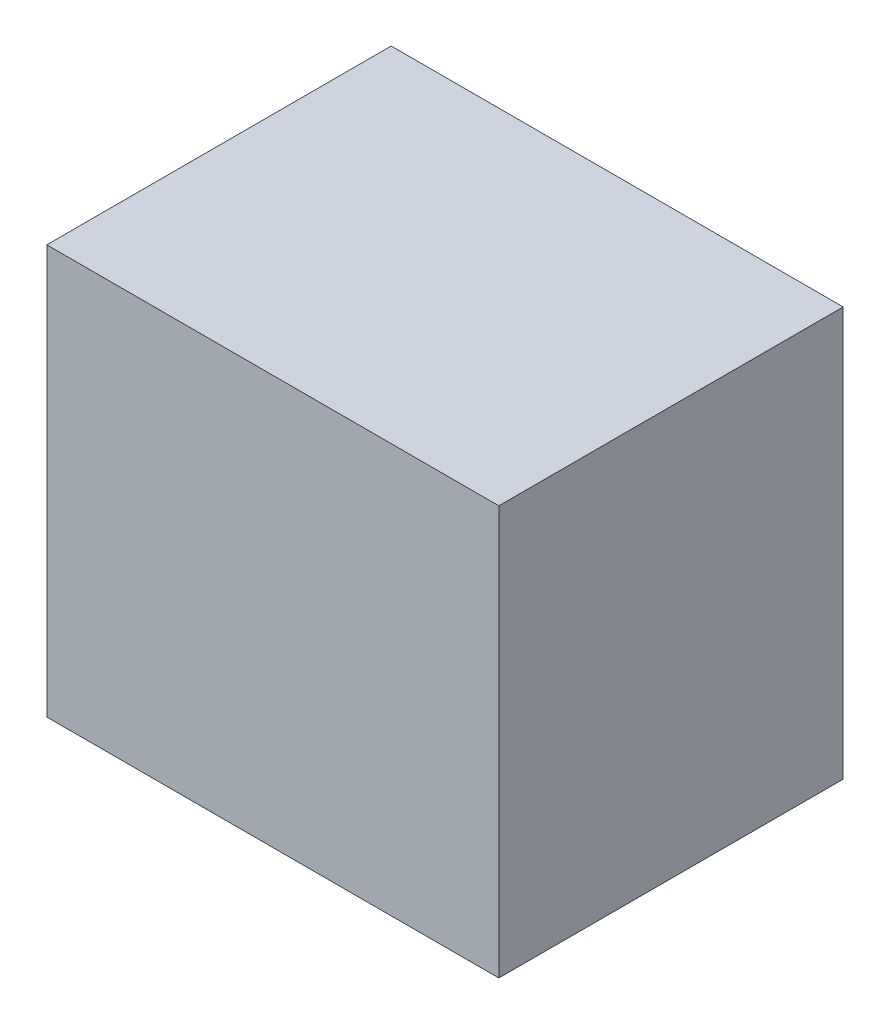
ISO-10303-21;
HEADER;
FILE_DESCRIPTION(('STEP AP214'),'2;1');
FILE_NAME('part.step','',(''),(''),'','','');
FILE_SCHEMA(('AUTOMOTIVE_DESIGN { 1 0 10303 214 1 1 1 1 }'));
ENDSEC;
DATA;
#1=APPLICATION_CONTEXT('core data for automotive mechanical design processes');
#2=APPLICATION_PROTOCOL_DEFINITION('international standard','automotive_design',2000,#1);
#3=PRODUCT_CONTEXT('',#1,'mechanical');
#4=PRODUCT('Part','Part','',(#3));
#5=PRODUCT_RELATED_PRODUCT_CATEGORY('part','',(#4));
#6=PRODUCT_DEFINITION_FORMATION('','',#4);
#7=PRODUCT_DEFINITION_CONTEXT('part definition',#1,'design');
#8=PRODUCT_DEFINITION('design','',#6,#7);
#9=PRODUCT_DEFINITION_SHAPE('','',#8);
#10=(LENGTH_UNIT() NAMED_UNIT(*) SI_UNIT(.MILLI.,.METRE.));
#11=(NAMED_UNIT(*) PLANE_ANGLE_UNIT() SI_UNIT($,.RADIAN.));
#12=(NAMED_UNIT(*) SI_UNIT($,.STERADIAN.) SOLID_ANGLE_UNIT());
#13=UNCERTAINTY_MEASURE_WITH_UNIT(LENGTH_MEASURE(1.E-05),#10,'distance_accuracy_value','');
#14=(GEOMETRIC_REPRESENTATION_CONTEXT(3) GLOBAL_UNCERTAINTY_ASSIGNED_CONTEXT((#13)) GLOBAL_UNIT_ASSIGNED_CONTEXT((#10,
#11,#12)) REPRESENTATION_CONTEXT('',''));
#15=CARTESIAN_POINT('',(0.,0.,0.));
#16=DIRECTION('',(0.,0.,1.));
#17=DIRECTION('',(1.,0.,0.));
#18=AXIS2_PLACEMENT_3D('',#15,#16,#17);
#19=CARTESIAN_POINT('',(0.52500022,-0.47500032,0.80000094));
#20=DIRECTION('',(0.,0.,-1.));
#21=DIRECTION('',(-1.,0.,0.));
#22=AXIS2_PLACEMENT_3D('',#19,#20,#21);
#23=PLANE('',#22);
#24=DIRECTION('',(1.,0.,0.));
#25=VECTOR('',#24,1.);
#26=CARTESIAN_POINT('',(0.52500022,0.47500032,0.80000094));
#27=LINE('',#26,#25);
#28=CARTESIAN_POINT('',(0.52500022,0.47500032,0.80000094));
#29=VERTEX_POINT('',#28);
#30=CARTESIAN_POINT('',(-0.52500022,0.47500032,0.80000094));
#31=VERTEX_POINT('',#30);
#32=EDGE_CURVE('E54',#29,#31,#27,.F.);
#33=ORIENTED_EDGE('',*,*,#32,.T.);
#34=DIRECTION('',(0.,1.,0.));
#35=VECTOR('',#34,1.);
#36=CARTESIAN_POINT('',(-0.52500022,0.47500032,0.80000094));
#37=LINE('',#36,#35);
#38=CARTESIAN_POINT('',(-0.52500022,-0.47500032,0.80000094));
#39=VERTEX_POINT('',#38);
#40=EDGE_CURVE('E56',#31,#39,#37,.F.);
#41=ORIENTED_EDGE('',*,*,#40,.T.);
#42=DIRECTION('',(1.,0.,0.));
#43=VECTOR('',#42,1.);
#44=CARTESIAN_POINT('',(-0.52500022,-0.47500032,0.80000094));
#45=LINE('',#44,#43);
#46=CARTESIAN_POINT('',(0.52500022,-0.47500032,0.80000094));
#47=VERTEX_POINT('',#46);
#48=EDGE_CURVE('E19',#39,#47,#45,.T.);
#49=ORIENTED_EDGE('',*,*,#48,.T.);
#50=DIRECTION('',(0.,1.,0.));
#51=VECTOR('',#50,1.);
#52=CARTESIAN_POINT('',(0.52500022,-0.47500032,0.80000094));
#53=LINE('',#52,#51);
#54=EDGE_CURVE('E79',#47,#29,#53,.T.);
#55=ORIENTED_EDGE('',*,*,#54,.T.);
#56=EDGE_LOOP('',(#33,#41,#49,#55));
#57=FACE_BOUND('',#56,.T.);
#58=ADVANCED_FACE('F16',(#57),#23,.F.);
#59=CARTESIAN_POINT('',(-0.52500022,-0.47500032,0.));
#60=DIRECTION('',(0.,1.,0.));
#61=DIRECTION('',(0.,0.,1.));
#62=AXIS2_PLACEMENT_3D('',#59,#60,#61);
#63=PLANE('',#62);
#64=DIRECTION('',(0.,0.,1.));
#65=VECTOR('',#64,1.);
#66=CARTESIAN_POINT('',(0.52500022,-0.47500032,0.));
#67=LINE('',#66,#65);
#68=CARTESIAN_POINT('',(0.52500022,-0.47500032,0.));
#69=VERTEX_POINT('',#68);
#70=EDGE_CURVE('E67',#69,#47,#67,.T.);
#71=ORIENTED_EDGE('',*,*,#70,.T.);
#72=ORIENTED_EDGE('',*,*,#48,.F.);
#73=DIRECTION('',(0.,0.,-1.));
#74=VECTOR('',#73,1.);
#75=CARTESIAN_POINT('',(-0.52500022,-0.47500032,0.));
#76=LINE('',#75,#74);
#77=CARTESIAN_POINT('',(-0.52500022,-0.47500032,0.));
#78=VERTEX_POINT('',#77);
#79=EDGE_CURVE('E62',#39,#78,#76,.T.);
#80=ORIENTED_EDGE('',*,*,#79,.T.);
#81=DIRECTION('',(-1.,0.,0.));
#82=VECTOR('',#81,1.);
#83=CARTESIAN_POINT('',(0.52500022,-0.47500032,0.));
#84=LINE('',#83,#82);
#85=EDGE_CURVE('E82',#69,#78,#84,.T.);
#86=ORIENTED_EDGE('',*,*,#85,.F.);
#87=EDGE_LOOP('',(#71,#72,#80,#86));
#88=FACE_BOUND('',#87,.T.);
#89=ADVANCED_FACE('F64',(#88),#63,.F.);
#90=CARTESIAN_POINT('',(-0.52500022,0.47500032,0.));
#91=DIRECTION('',(1.,0.,0.));
#92=DIRECTION('',(0.,0.,-1.));
#93=AXIS2_PLACEMENT_3D('',#90,#91,#92);
#94=PLANE('',#93);
#95=ORIENTED_EDGE('',*,*,#79,.F.);
#96=ORIENTED_EDGE('',*,*,#40,.F.);
#97=DIRECTION('',(0.,0.,-1.));
#98=VECTOR('',#97,1.);
#99=CARTESIAN_POINT('',(-0.52500022,0.47500032,0.));
#100=LINE('',#99,#98);
#101=CARTESIAN_POINT('',(-0.52500022,0.47500032,0.));
#102=VERTEX_POINT('',#101);
#103=EDGE_CURVE('E74',#31,#102,#100,.T.);
#104=ORIENTED_EDGE('',*,*,#103,.T.);
#105=DIRECTION('',(0.,1.,0.));
#106=VECTOR('',#105,1.);
#107=CARTESIAN_POINT('',(-0.52500022,-0.47500032,0.));
#108=LINE('',#107,#106);
#109=EDGE_CURVE('E71',#78,#102,#108,.T.);
#110=ORIENTED_EDGE('',*,*,#109,.F.);
#111=EDGE_LOOP('',(#95,#96,#104,#110));
#112=FACE_BOUND('',#111,.T.);
#113=ADVANCED_FACE('F69',(#112),#94,.F.);
#114=CARTESIAN_POINT('',(0.52500022,0.47500032,0.));
#115=DIRECTION('',(0.,-1.,0.));
#116=DIRECTION('',(0.,0.,-1.));
#117=AXIS2_PLACEMENT_3D('',#114,#115,#116);
#118=PLANE('',#117);
#119=ORIENTED_EDGE('',*,*,#103,.F.);
#120=ORIENTED_EDGE('',*,*,#32,.F.);
#121=DIRECTION('',(0.,0.,1.));
#122=VECTOR('',#121,1.);
#123=CARTESIAN_POINT('',(0.52500022,0.47500032,0.));
#124=LINE('',#123,#122);
#125=CARTESIAN_POINT('',(0.52500022,0.47500032,0.));
#126=VERTEX_POINT('',#125);
#127=EDGE_CURVE('E34',#29,#126,#124,.F.);
#128=ORIENTED_EDGE('',*,*,#127,.T.);
#129=DIRECTION('',(-1.,0.,0.));
#130=VECTOR('',#129,1.);
#131=CARTESIAN_POINT('',(0.52500022,0.47500032,0.));
#132=LINE('',#131,#130);
#133=EDGE_CURVE('E25',#102,#126,#132,.F.);
#134=ORIENTED_EDGE('',*,*,#133,.F.);
#135=EDGE_LOOP('',(#119,#120,#128,#134));
#136=FACE_BOUND('',#135,.T.);
#137=ADVANCED_FACE('F88',(#136),#118,.F.);
#138=CARTESIAN_POINT('',(0.52500022,-0.47500032,0.));
#139=DIRECTION('',(-1.,0.,0.));
#140=DIRECTION('',(0.,0.,1.));
#141=AXIS2_PLACEMENT_3D('',#138,#139,#140);
#142=PLANE('',#141);
#143=ORIENTED_EDGE('',*,*,#127,.F.);
#144=ORIENTED_EDGE('',*,*,#54,.F.);
#145=ORIENTED_EDGE('',*,*,#70,.F.);
#146=DIRECTION('',(0.,1.,0.));
#147=VECTOR('',#146,1.);
#148=CARTESIAN_POINT('',(0.52500022,-0.47500032,0.));
#149=LINE('',#148,#147);
#150=EDGE_CURVE('E11',#126,#69,#149,.F.);
#151=ORIENTED_EDGE('',*,*,#150,.F.);
#152=EDGE_LOOP('',(#143,#144,#145,#151));
#153=FACE_BOUND('',#152,.T.);
#154=ADVANCED_FACE('F90',(#153),#142,.F.);
#155=CARTESIAN_POINT('',(0.52500022,-0.47500032,0.));
#156=DIRECTION('',(0.,0.,-1.));
#157=DIRECTION('',(-1.,0.,0.));
#158=AXIS2_PLACEMENT_3D('',#155,#156,#157);
#159=PLANE('',#158);
#160=ORIENTED_EDGE('',*,*,#133,.T.);
#161=ORIENTED_EDGE('',*,*,#150,.T.);
#162=ORIENTED_EDGE('',*,*,#85,.T.);
#163=ORIENTED_EDGE('',*,*,#109,.T.);
#164=EDGE_LOOP('',(#160,#161,#162,#163));
#165=FACE_BOUND('',#164,.T.);
#166=ADVANCED_FACE('F87',(#165),#159,.T.);
#167=CLOSED_SHELL('',(#58,#89,#113,#137,#154,#166));
#168=MANIFOLD_SOLID_BREP('B1',#167);
#169=ADVANCED_BREP_SHAPE_REPRESENTATION('',(#18,#168),#14);
#170=SHAPE_DEFINITION_REPRESENTATION(#9,#169);
ENDSEC;
END-ISO-10303-21;
